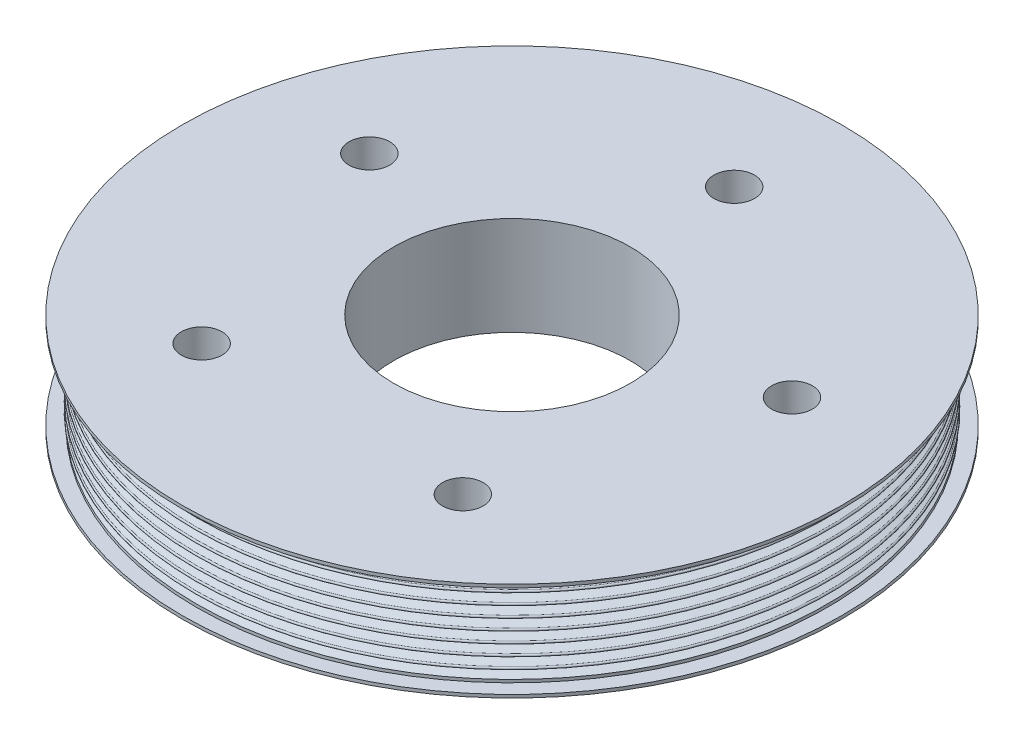
ISO-10303-21;
HEADER;
FILE_DESCRIPTION(('STEP AP214'),'2;1');
FILE_NAME('part.step','',(''),(''),'','','');
FILE_SCHEMA(('AUTOMOTIVE_DESIGN { 1 0 10303 214 1 1 1 1 }'));
ENDSEC;
DATA;
#1=APPLICATION_CONTEXT('core data for automotive mechanical design processes');
#2=APPLICATION_PROTOCOL_DEFINITION('international standard','automotive_design',2000,#1);
#3=PRODUCT_CONTEXT('',#1,'mechanical');
#4=PRODUCT('Part','Part','',(#3));
#5=PRODUCT_RELATED_PRODUCT_CATEGORY('part','',(#4));
#6=PRODUCT_DEFINITION_FORMATION('','',#4);
#7=PRODUCT_DEFINITION_CONTEXT('part definition',#1,'design');
#8=PRODUCT_DEFINITION('design','',#6,#7);
#9=PRODUCT_DEFINITION_SHAPE('','',#8);
#10=(LENGTH_UNIT() NAMED_UNIT(*) SI_UNIT(.MILLI.,.METRE.));
#11=(NAMED_UNIT(*) PLANE_ANGLE_UNIT() SI_UNIT($,.RADIAN.));
#12=(NAMED_UNIT(*) SI_UNIT($,.STERADIAN.) SOLID_ANGLE_UNIT());
#13=UNCERTAINTY_MEASURE_WITH_UNIT(LENGTH_MEASURE(1.E-05),#10,'distance_accuracy_value','');
#14=(GEOMETRIC_REPRESENTATION_CONTEXT(3) GLOBAL_UNCERTAINTY_ASSIGNED_CONTEXT((#13)) GLOBAL_UNIT_ASSIGNED_CONTEXT((#10,
#11,#12)) REPRESENTATION_CONTEXT('',''));
#15=CARTESIAN_POINT('',(0.,0.,0.));
#16=DIRECTION('',(0.,0.,1.));
#17=DIRECTION('',(1.,0.,0.));
#18=AXIS2_PLACEMENT_3D('',#15,#16,#17);
#19=CARTESIAN_POINT('',(106.172,-15.87246,0.));
#20=DIRECTION('',(0.,1.,0.));
#21=DIRECTION('',(0.,0.,1.));
#22=AXIS2_PLACEMENT_3D('',#19,#20,#21);
#23=PLANE('',#22);
#24=CARTESIAN_POINT('',(0.,-15.87246,0.));
#25=DIRECTION('',(0.,1.,0.));
#26=DIRECTION('',(0.,0.,1.));
#27=AXIS2_PLACEMENT_3D('',#24,#25,#26);
#28=CIRCLE('',#27,106.172);
#29=CARTESIAN_POINT('',(0.,-15.87246,106.172));
#30=VERTEX_POINT('',#29);
#31=EDGE_CURVE('E10',#30,#30,#28,.T.);
#32=ORIENTED_EDGE('',*,*,#31,.F.);
#33=EDGE_LOOP('',(#32));
#34=FACE_BOUND('',#33,.T.);
#35=CARTESIAN_POINT('',(0.,-15.87246,0.));
#36=DIRECTION('',(0.,1.,0.));
#37=DIRECTION('',(0.,0.,1.));
#38=AXIS2_PLACEMENT_3D('',#35,#36,#37);
#39=CIRCLE('',#38,38.1);
#40=CARTESIAN_POINT('',(0.,-15.87246,38.1));
#41=VERTEX_POINT('',#40);
#42=EDGE_CURVE('E154',#41,#41,#39,.T.);
#43=ORIENTED_EDGE('',*,*,#42,.T.);
#44=EDGE_LOOP('',(#43));
#45=FACE_BOUND('',#44,.T.);
#46=CARTESIAN_POINT('',(0.,-15.87246,-71.5518));
#47=DIRECTION('',(0.,-1.,0.));
#48=DIRECTION('',(0.,0.,-1.));
#49=AXIS2_PLACEMENT_3D('',#46,#47,#48);
#50=CIRCLE('',#49,6.54812);
#51=CARTESIAN_POINT('',(0.,-15.87246,-78.09992));
#52=VERTEX_POINT('',#51);
#53=EDGE_CURVE('E163',#52,#52,#50,.T.);
#54=ORIENTED_EDGE('',*,*,#53,.F.);
#55=EDGE_LOOP('',(#54));
#56=FACE_BOUND('',#55,.T.);
#57=CARTESIAN_POINT('',(-68.0498056426477,-15.87246,-22.1107221781172));
#58=DIRECTION('',(0.,-1.,0.));
#59=DIRECTION('',(0.,0.,-1.));
#60=AXIS2_PLACEMENT_3D('',#57,#58,#59);
#61=CIRCLE('',#60,6.54812);
#62=CARTESIAN_POINT('',(-68.0498056426477,-15.87246,-28.6588421781172));
#63=VERTEX_POINT('',#62);
#64=EDGE_CURVE('E169',#63,#63,#61,.T.);
#65=ORIENTED_EDGE('',*,*,#64,.F.);
#66=EDGE_LOOP('',(#65));
#67=FACE_BOUND('',#66,.T.);
#68=CARTESIAN_POINT('',(-42.0570928149803,-15.87246,57.8866221781176));
#69=DIRECTION('',(0.,-1.,0.));
#70=DIRECTION('',(0.,0.,-1.));
#71=AXIS2_PLACEMENT_3D('',#68,#69,#70);
#72=CIRCLE('',#71,6.54812);
#73=CARTESIAN_POINT('',(-42.0570928149803,-15.87246,51.3385021781176));
#74=VERTEX_POINT('',#73);
#75=EDGE_CURVE('E175',#74,#74,#72,.T.);
#76=ORIENTED_EDGE('',*,*,#75,.F.);
#77=EDGE_LOOP('',(#76));
#78=FACE_BOUND('',#77,.T.);
#79=CARTESIAN_POINT('',(42.0570928149811,-15.87246,57.886622178117));
#80=DIRECTION('',(0.,-1.,0.));
#81=DIRECTION('',(0.,0.,-1.));
#82=AXIS2_PLACEMENT_3D('',#79,#80,#81);
#83=CIRCLE('',#82,6.54812);
#84=CARTESIAN_POINT('',(42.0570928149811,-15.87246,51.338502178117));
#85=VERTEX_POINT('',#84);
#86=EDGE_CURVE('E181',#85,#85,#83,.T.);
#87=ORIENTED_EDGE('',*,*,#86,.F.);
#88=EDGE_LOOP('',(#87));
#89=FACE_BOUND('',#88,.T.);
#90=CARTESIAN_POINT('',(68.0498056426473,-15.87246,-22.1107221781181));
#91=DIRECTION('',(0.,-1.,0.));
#92=DIRECTION('',(0.,0.,-1.));
#93=AXIS2_PLACEMENT_3D('',#90,#91,#92);
#94=CIRCLE('',#93,6.54811999999999);
#95=CARTESIAN_POINT('',(68.0498056426473,-15.87246,-28.6588421781181));
#96=VERTEX_POINT('',#95);
#97=EDGE_CURVE('E187',#96,#96,#94,.T.);
#98=ORIENTED_EDGE('',*,*,#97,.F.);
#99=EDGE_LOOP('',(#98));
#100=FACE_BOUND('',#99,.T.);
#101=ADVANCED_FACE('F33',(#34,#45,#56,#67,#78,#89,#100),#23,.F.);
#102=CARTESIAN_POINT('',(0.,15.87246,0.));
#103=DIRECTION('',(0.,1.,0.));
#104=DIRECTION('',(0.,0.,1.));
#105=AXIS2_PLACEMENT_3D('',#102,#103,#104);
#106=CYLINDRICAL_SURFACE('',#105,106.172);
#107=CARTESIAN_POINT('',(0.,-14.85646,0.));
#108=DIRECTION('',(0.,1.,0.));
#109=DIRECTION('',(0.,0.,1.));
#110=AXIS2_PLACEMENT_3D('',#107,#108,#109);
#111=CIRCLE('',#110,106.172);
#112=CARTESIAN_POINT('',(0.,-14.85646,106.172));
#113=VERTEX_POINT('',#112);
#114=EDGE_CURVE('E39',#113,#113,#111,.T.);
#115=ORIENTED_EDGE('',*,*,#114,.F.);
#116=EDGE_LOOP('',(#115));
#117=FACE_BOUND('',#116,.T.);
#118=ORIENTED_EDGE('',*,*,#31,.T.);
#119=EDGE_LOOP('',(#118));
#120=FACE_BOUND('',#119,.T.);
#121=ADVANCED_FACE('F194',(#117,#120),#106,.T.);
#122=CARTESIAN_POINT('',(106.172,-14.85646,0.));
#123=DIRECTION('',(0.,-1.,0.));
#124=DIRECTION('',(0.,0.,-1.));
#125=AXIS2_PLACEMENT_3D('',#122,#123,#124);
#126=PLANE('',#125);
#127=CARTESIAN_POINT('',(0.,-14.85646,0.));
#128=DIRECTION('',(0.,1.,0.));
#129=DIRECTION('',(0.,0.,1.));
#130=AXIS2_PLACEMENT_3D('',#127,#128,#129);
#131=CIRCLE('',#130,101.6);
#132=CARTESIAN_POINT('',(0.,-14.85646,101.6));
#133=VERTEX_POINT('',#132);
#134=EDGE_CURVE('E43',#133,#133,#131,.T.);
#135=ORIENTED_EDGE('',*,*,#134,.F.);
#136=EDGE_LOOP('',(#135));
#137=FACE_BOUND('',#136,.T.);
#138=ORIENTED_EDGE('',*,*,#114,.T.);
#139=EDGE_LOOP('',(#138));
#140=FACE_BOUND('',#139,.T.);
#141=ADVANCED_FACE('F199',(#137,#140),#126,.F.);
#142=CARTESIAN_POINT('',(0.,15.87246,0.));
#143=DIRECTION('',(0.,1.,0.));
#144=DIRECTION('',(0.,0.,1.));
#145=AXIS2_PLACEMENT_3D('',#142,#143,#144);
#146=CYLINDRICAL_SURFACE('',#145,101.6);
#147=CARTESIAN_POINT('',(0.,-13.90396,0.));
#148=DIRECTION('',(0.,1.,0.));
#149=DIRECTION('',(0.,0.,1.));
#150=AXIS2_PLACEMENT_3D('',#147,#148,#149);
#151=CIRCLE('',#150,101.6);
#152=CARTESIAN_POINT('',(0.,-13.90396,101.6));
#153=VERTEX_POINT('',#152);
#154=EDGE_CURVE('E47',#153,#153,#151,.T.);
#155=ORIENTED_EDGE('',*,*,#154,.F.);
#156=EDGE_LOOP('',(#155));
#157=FACE_BOUND('',#156,.T.);
#158=ORIENTED_EDGE('',*,*,#134,.T.);
#159=EDGE_LOOP('',(#158));
#160=FACE_BOUND('',#159,.T.);
#161=ADVANCED_FACE('F378',(#157,#160),#146,.T.);
#162=CARTESIAN_POINT('',(0.,-13.90396,0.));
#163=DIRECTION('',(0.,-1.,0.));
#164=DIRECTION('',(0.,0.,-1.));
#165=AXIS2_PLACEMENT_3D('',#162,#163,#164);
#166=CONICAL_SURFACE('',#165,101.6,1.22173047639603);
#167=CARTESIAN_POINT('',(0.,-12.88034,0.));
#168=DIRECTION('',(0.,1.,0.));
#169=DIRECTION('',(0.,0.,1.));
#170=AXIS2_PLACEMENT_3D('',#167,#168,#169);
#171=CIRCLE('',#170,98.7876271638978);
#172=CARTESIAN_POINT('',(0.,-12.88034,98.7876271638978));
#173=VERTEX_POINT('',#172);
#174=EDGE_CURVE('E52',#173,#173,#171,.T.);
#175=ORIENTED_EDGE('',*,*,#174,.F.);
#176=EDGE_LOOP('',(#175));
#177=FACE_BOUND('',#176,.T.);
#178=ORIENTED_EDGE('',*,*,#154,.T.);
#179=EDGE_LOOP('',(#178));
#180=FACE_BOUND('',#179,.T.);
#181=ADVANCED_FACE('F374',(#177,#180),#166,.T.);
#182=CARTESIAN_POINT('',(0.,-12.49934,0.));
#183=DIRECTION('',(0.,1.,0.));
#184=DIRECTION('',(0.,0.,1.));
#185=AXIS2_PLACEMENT_3D('',#182,#183,#184);
#186=TOROIDAL_SURFACE('',#185,98.7876271638978,0.380999999999995);
#187=CARTESIAN_POINT('',(0.,-12.11834,0.));
#188=DIRECTION('',(0.,1.,0.));
#189=DIRECTION('',(0.,0.,1.));
#190=AXIS2_PLACEMENT_3D('',#187,#188,#189);
#191=CIRCLE('',#190,98.7876271638978);
#192=CARTESIAN_POINT('',(0.,-12.11834,98.7876271638978));
#193=VERTEX_POINT('',#192);
#194=EDGE_CURVE('E55',#193,#193,#191,.T.);
#195=ORIENTED_EDGE('',*,*,#194,.F.);
#196=EDGE_LOOP('',(#195));
#197=FACE_BOUND('',#196,.T.);
#198=ORIENTED_EDGE('',*,*,#174,.T.);
#199=EDGE_LOOP('',(#198));
#200=FACE_BOUND('',#199,.T.);
#201=ADVANCED_FACE('F370',(#197,#200),#186,.F.);
#202=CARTESIAN_POINT('',(0.,-12.11834,0.));
#203=DIRECTION('',(0.,1.,0.));
#204=DIRECTION('',(0.,0.,1.));
#205=AXIS2_PLACEMENT_3D('',#202,#203,#204);
#206=CONICAL_SURFACE('',#205,98.7876271638978,1.22173047639604);
#207=CARTESIAN_POINT('',(0.,-11.09472,0.));
#208=DIRECTION('',(0.,1.,0.));
#209=DIRECTION('',(0.,0.,1.));
#210=AXIS2_PLACEMENT_3D('',#207,#208,#209);
#211=CIRCLE('',#210,101.6);
#212=CARTESIAN_POINT('',(0.,-11.09472,101.6));
#213=VERTEX_POINT('',#212);
#214=EDGE_CURVE('E58',#213,#213,#211,.T.);
#215=ORIENTED_EDGE('',*,*,#214,.F.);
#216=EDGE_LOOP('',(#215));
#217=FACE_BOUND('',#216,.T.);
#218=ORIENTED_EDGE('',*,*,#194,.T.);
#219=EDGE_LOOP('',(#218));
#220=FACE_BOUND('',#219,.T.);
#221=ADVANCED_FACE('F366',(#217,#220),#206,.T.);
#222=CARTESIAN_POINT('',(0.,-10.71372,0.));
#223=DIRECTION('',(0.,1.,0.));
#224=DIRECTION('',(0.,0.,1.));
#225=AXIS2_PLACEMENT_3D('',#222,#223,#224);
#226=TOROIDAL_SURFACE('',#225,101.6,0.380999999999999);
#227=CARTESIAN_POINT('',(0.,-10.33272,0.));
#228=DIRECTION('',(0.,1.,0.));
#229=DIRECTION('',(0.,0.,1.));
#230=AXIS2_PLACEMENT_3D('',#227,#228,#229);
#231=CIRCLE('',#230,101.6);
#232=CARTESIAN_POINT('',(0.,-10.33272,101.6));
#233=VERTEX_POINT('',#232);
#234=EDGE_CURVE('E61',#233,#233,#231,.T.);
#235=ORIENTED_EDGE('',*,*,#234,.F.);
#236=EDGE_LOOP('',(#235));
#237=FACE_BOUND('',#236,.T.);
#238=ORIENTED_EDGE('',*,*,#214,.T.);
#239=EDGE_LOOP('',(#238));
#240=FACE_BOUND('',#239,.T.);
#241=ADVANCED_FACE('F362',(#237,#240),#226,.T.);
#242=CARTESIAN_POINT('',(0.,-10.33272,0.));
#243=DIRECTION('',(0.,-1.,0.));
#244=DIRECTION('',(0.,0.,-1.));
#245=AXIS2_PLACEMENT_3D('',#242,#243,#244);
#246=CONICAL_SURFACE('',#245,101.6,1.22173047639603);
#247=CARTESIAN_POINT('',(0.,-9.30909999999999,0.));
#248=DIRECTION('',(0.,1.,0.));
#249=DIRECTION('',(0.,0.,1.));
#250=AXIS2_PLACEMENT_3D('',#247,#248,#249);
#251=CIRCLE('',#250,98.7876271638978);
#252=CARTESIAN_POINT('',(0.,-9.30909999999999,98.7876271638978));
#253=VERTEX_POINT('',#252);
#254=EDGE_CURVE('E64',#253,#253,#251,.T.);
#255=ORIENTED_EDGE('',*,*,#254,.F.);
#256=EDGE_LOOP('',(#255));
#257=FACE_BOUND('',#256,.T.);
#258=ORIENTED_EDGE('',*,*,#234,.T.);
#259=EDGE_LOOP('',(#258));
#260=FACE_BOUND('',#259,.T.);
#261=ADVANCED_FACE('F358',(#257,#260),#246,.T.);
#262=CARTESIAN_POINT('',(0.,-8.92809999999999,0.));
#263=DIRECTION('',(0.,1.,0.));
#264=DIRECTION('',(0.,0.,1.));
#265=AXIS2_PLACEMENT_3D('',#262,#263,#264);
#266=TOROIDAL_SURFACE('',#265,98.7876271638978,0.381);
#267=CARTESIAN_POINT('',(0.,-8.54709999999999,0.));
#268=DIRECTION('',(0.,1.,0.));
#269=DIRECTION('',(0.,0.,1.));
#270=AXIS2_PLACEMENT_3D('',#267,#268,#269);
#271=CIRCLE('',#270,98.7876271638978);
#272=CARTESIAN_POINT('',(0.,-8.54709999999999,98.7876271638978));
#273=VERTEX_POINT('',#272);
#274=EDGE_CURVE('E67',#273,#273,#271,.T.);
#275=ORIENTED_EDGE('',*,*,#274,.F.);
#276=EDGE_LOOP('',(#275));
#277=FACE_BOUND('',#276,.T.);
#278=ORIENTED_EDGE('',*,*,#254,.T.);
#279=EDGE_LOOP('',(#278));
#280=FACE_BOUND('',#279,.T.);
#281=ADVANCED_FACE('F354',(#277,#280),#266,.F.);
#282=CARTESIAN_POINT('',(0.,-8.54709999999999,0.));
#283=DIRECTION('',(0.,1.,0.));
#284=DIRECTION('',(0.,0.,1.));
#285=AXIS2_PLACEMENT_3D('',#282,#283,#284);
#286=CONICAL_SURFACE('',#285,98.7876271638978,1.22173047639604);
#287=CARTESIAN_POINT('',(0.,-7.52348,0.));
#288=DIRECTION('',(0.,1.,0.));
#289=DIRECTION('',(0.,0.,1.));
#290=AXIS2_PLACEMENT_3D('',#287,#288,#289);
#291=CIRCLE('',#290,101.6);
#292=CARTESIAN_POINT('',(0.,-7.52348,101.6));
#293=VERTEX_POINT('',#292);
#294=EDGE_CURVE('E70',#293,#293,#291,.T.);
#295=ORIENTED_EDGE('',*,*,#294,.F.);
#296=EDGE_LOOP('',(#295));
#297=FACE_BOUND('',#296,.T.);
#298=ORIENTED_EDGE('',*,*,#274,.T.);
#299=EDGE_LOOP('',(#298));
#300=FACE_BOUND('',#299,.T.);
#301=ADVANCED_FACE('F350',(#297,#300),#286,.T.);
#302=CARTESIAN_POINT('',(0.,-7.14248,0.));
#303=DIRECTION('',(0.,1.,0.));
#304=DIRECTION('',(0.,0.,1.));
#305=AXIS2_PLACEMENT_3D('',#302,#303,#304);
#306=TOROIDAL_SURFACE('',#305,101.6,0.381000000000001);
#307=CARTESIAN_POINT('',(0.,-6.76148,0.));
#308=DIRECTION('',(0.,1.,0.));
#309=DIRECTION('',(0.,0.,1.));
#310=AXIS2_PLACEMENT_3D('',#307,#308,#309);
#311=CIRCLE('',#310,101.6);
#312=CARTESIAN_POINT('',(0.,-6.76148,101.6));
#313=VERTEX_POINT('',#312);
#314=EDGE_CURVE('E73',#313,#313,#311,.T.);
#315=ORIENTED_EDGE('',*,*,#314,.F.);
#316=EDGE_LOOP('',(#315));
#317=FACE_BOUND('',#316,.T.);
#318=ORIENTED_EDGE('',*,*,#294,.T.);
#319=EDGE_LOOP('',(#318));
#320=FACE_BOUND('',#319,.T.);
#321=ADVANCED_FACE('F346',(#317,#320),#306,.T.);
#322=CARTESIAN_POINT('',(0.,-6.76148,0.));
#323=DIRECTION('',(0.,-1.,0.));
#324=DIRECTION('',(0.,0.,-1.));
#325=AXIS2_PLACEMENT_3D('',#322,#323,#324);
#326=CONICAL_SURFACE('',#325,101.6,1.22173047639603);
#327=CARTESIAN_POINT('',(0.,-5.73785999999998,0.));
#328=DIRECTION('',(0.,1.,0.));
#329=DIRECTION('',(0.,0.,1.));
#330=AXIS2_PLACEMENT_3D('',#327,#328,#329);
#331=CIRCLE('',#330,98.7876271638978);
#332=CARTESIAN_POINT('',(0.,-5.73785999999998,98.7876271638978));
#333=VERTEX_POINT('',#332);
#334=EDGE_CURVE('E76',#333,#333,#331,.T.);
#335=ORIENTED_EDGE('',*,*,#334,.F.);
#336=EDGE_LOOP('',(#335));
#337=FACE_BOUND('',#336,.T.);
#338=ORIENTED_EDGE('',*,*,#314,.T.);
#339=EDGE_LOOP('',(#338));
#340=FACE_BOUND('',#339,.T.);
#341=ADVANCED_FACE('F342',(#337,#340),#326,.T.);
#342=CARTESIAN_POINT('',(0.,-5.35685999999998,0.));
#343=DIRECTION('',(0.,1.,0.));
#344=DIRECTION('',(0.,0.,1.));
#345=AXIS2_PLACEMENT_3D('',#342,#343,#344);
#346=TOROIDAL_SURFACE('',#345,98.7876271638978,0.381);
#347=CARTESIAN_POINT('',(0.,-4.97585999999998,0.));
#348=DIRECTION('',(0.,1.,0.));
#349=DIRECTION('',(0.,0.,1.));
#350=AXIS2_PLACEMENT_3D('',#347,#348,#349);
#351=CIRCLE('',#350,98.7876271638978);
#352=CARTESIAN_POINT('',(0.,-4.97585999999998,98.7876271638978));
#353=VERTEX_POINT('',#352);
#354=EDGE_CURVE('E79',#353,#353,#351,.T.);
#355=ORIENTED_EDGE('',*,*,#354,.F.);
#356=EDGE_LOOP('',(#355));
#357=FACE_BOUND('',#356,.T.);
#358=ORIENTED_EDGE('',*,*,#334,.T.);
#359=EDGE_LOOP('',(#358));
#360=FACE_BOUND('',#359,.T.);
#361=ADVANCED_FACE('F338',(#357,#360),#346,.F.);
#362=CARTESIAN_POINT('',(0.,-4.97585999999998,0.));
#363=DIRECTION('',(0.,1.,0.));
#364=DIRECTION('',(0.,0.,1.));
#365=AXIS2_PLACEMENT_3D('',#362,#363,#364);
#366=CONICAL_SURFACE('',#365,98.7876271638978,1.22173047639604);
#367=CARTESIAN_POINT('',(0.,-3.95223999999999,0.));
#368=DIRECTION('',(0.,1.,0.));
#369=DIRECTION('',(0.,0.,1.));
#370=AXIS2_PLACEMENT_3D('',#367,#368,#369);
#371=CIRCLE('',#370,101.6);
#372=CARTESIAN_POINT('',(0.,-3.95223999999999,101.6));
#373=VERTEX_POINT('',#372);
#374=EDGE_CURVE('E82',#373,#373,#371,.T.);
#375=ORIENTED_EDGE('',*,*,#374,.F.);
#376=EDGE_LOOP('',(#375));
#377=FACE_BOUND('',#376,.T.);
#378=ORIENTED_EDGE('',*,*,#354,.T.);
#379=EDGE_LOOP('',(#378));
#380=FACE_BOUND('',#379,.T.);
#381=ADVANCED_FACE('F334',(#377,#380),#366,.T.);
#382=CARTESIAN_POINT('',(0.,-3.57123999999999,0.));
#383=DIRECTION('',(0.,1.,0.));
#384=DIRECTION('',(0.,0.,1.));
#385=AXIS2_PLACEMENT_3D('',#382,#383,#384);
#386=TOROIDAL_SURFACE('',#385,101.6,0.380999999999999);
#387=CARTESIAN_POINT('',(0.,-3.19023999999999,0.));
#388=DIRECTION('',(0.,1.,0.));
#389=DIRECTION('',(0.,0.,1.));
#390=AXIS2_PLACEMENT_3D('',#387,#388,#389);
#391=CIRCLE('',#390,101.6);
#392=CARTESIAN_POINT('',(0.,-3.19023999999999,101.6));
#393=VERTEX_POINT('',#392);
#394=EDGE_CURVE('E85',#393,#393,#391,.T.);
#395=ORIENTED_EDGE('',*,*,#394,.F.);
#396=EDGE_LOOP('',(#395));
#397=FACE_BOUND('',#396,.T.);
#398=ORIENTED_EDGE('',*,*,#374,.T.);
#399=EDGE_LOOP('',(#398));
#400=FACE_BOUND('',#399,.T.);
#401=ADVANCED_FACE('F330',(#397,#400),#386,.T.);
#402=CARTESIAN_POINT('',(0.,-3.19023999999999,0.));
#403=DIRECTION('',(0.,-1.,0.));
#404=DIRECTION('',(0.,0.,-1.));
#405=AXIS2_PLACEMENT_3D('',#402,#403,#404);
#406=CONICAL_SURFACE('',#405,101.6,1.22173047639603);
#407=CARTESIAN_POINT('',(0.,-2.16661999999999,0.));
#408=DIRECTION('',(0.,1.,0.));
#409=DIRECTION('',(0.,0.,1.));
#410=AXIS2_PLACEMENT_3D('',#407,#408,#409);
#411=CIRCLE('',#410,98.7876271638978);
#412=CARTESIAN_POINT('',(0.,-2.16661999999999,98.7876271638978));
#413=VERTEX_POINT('',#412);
#414=EDGE_CURVE('E88',#413,#413,#411,.T.);
#415=ORIENTED_EDGE('',*,*,#414,.F.);
#416=EDGE_LOOP('',(#415));
#417=FACE_BOUND('',#416,.T.);
#418=ORIENTED_EDGE('',*,*,#394,.T.);
#419=EDGE_LOOP('',(#418));
#420=FACE_BOUND('',#419,.T.);
#421=ADVANCED_FACE('F326',(#417,#420),#406,.T.);
#422=CARTESIAN_POINT('',(0.,-1.78561999999999,0.));
#423=DIRECTION('',(0.,1.,0.));
#424=DIRECTION('',(0.,0.,1.));
#425=AXIS2_PLACEMENT_3D('',#422,#423,#424);
#426=TOROIDAL_SURFACE('',#425,98.7876271638978,0.381);
#427=CARTESIAN_POINT('',(0.,-1.40461999999999,0.));
#428=DIRECTION('',(0.,1.,0.));
#429=DIRECTION('',(0.,0.,1.));
#430=AXIS2_PLACEMENT_3D('',#427,#428,#429);
#431=CIRCLE('',#430,98.7876271638978);
#432=CARTESIAN_POINT('',(0.,-1.40461999999999,98.7876271638978));
#433=VERTEX_POINT('',#432);
#434=EDGE_CURVE('E91',#433,#433,#431,.T.);
#435=ORIENTED_EDGE('',*,*,#434,.F.);
#436=EDGE_LOOP('',(#435));
#437=FACE_BOUND('',#436,.T.);
#438=ORIENTED_EDGE('',*,*,#414,.T.);
#439=EDGE_LOOP('',(#438));
#440=FACE_BOUND('',#439,.T.);
#441=ADVANCED_FACE('F322',(#437,#440),#426,.F.);
#442=CARTESIAN_POINT('',(0.,-1.40461999999999,0.));
#443=DIRECTION('',(0.,1.,0.));
#444=DIRECTION('',(0.,0.,1.));
#445=AXIS2_PLACEMENT_3D('',#442,#443,#444);
#446=CONICAL_SURFACE('',#445,98.7876271638978,1.22173047639604);
#447=CARTESIAN_POINT('',(0.,-0.381000000000003,0.));
#448=DIRECTION('',(0.,1.,0.));
#449=DIRECTION('',(0.,0.,1.));
#450=AXIS2_PLACEMENT_3D('',#447,#448,#449);
#451=CIRCLE('',#450,101.6);
#452=CARTESIAN_POINT('',(0.,-0.381000000000003,101.6));
#453=VERTEX_POINT('',#452);
#454=EDGE_CURVE('E94',#453,#453,#451,.T.);
#455=ORIENTED_EDGE('',*,*,#454,.F.);
#456=EDGE_LOOP('',(#455));
#457=FACE_BOUND('',#456,.T.);
#458=ORIENTED_EDGE('',*,*,#434,.T.);
#459=EDGE_LOOP('',(#458));
#460=FACE_BOUND('',#459,.T.);
#461=ADVANCED_FACE('F318',(#457,#460),#446,.T.);
#462=CARTESIAN_POINT('',(0.,0.,0.));
#463=DIRECTION('',(0.,1.,0.));
#464=DIRECTION('',(0.,0.,1.));
#465=AXIS2_PLACEMENT_3D('',#462,#463,#464);
#466=TOROIDAL_SURFACE('',#465,101.6,0.381);
#467=CARTESIAN_POINT('',(0.,0.380999999999998,0.));
#468=DIRECTION('',(0.,1.,0.));
#469=DIRECTION('',(0.,0.,1.));
#470=AXIS2_PLACEMENT_3D('',#467,#468,#469);
#471=CIRCLE('',#470,101.6);
#472=CARTESIAN_POINT('',(0.,0.380999999999998,101.6));
#473=VERTEX_POINT('',#472);
#474=EDGE_CURVE('E97',#473,#473,#471,.T.);
#475=ORIENTED_EDGE('',*,*,#474,.F.);
#476=EDGE_LOOP('',(#475));
#477=FACE_BOUND('',#476,.T.);
#478=ORIENTED_EDGE('',*,*,#454,.T.);
#479=EDGE_LOOP('',(#478));
#480=FACE_BOUND('',#479,.T.);
#481=ADVANCED_FACE('F314',(#477,#480),#466,.T.);
#482=CARTESIAN_POINT('',(0.,0.380999999999998,0.));
#483=DIRECTION('',(0.,-1.,0.));
#484=DIRECTION('',(0.,0.,-1.));
#485=AXIS2_PLACEMENT_3D('',#482,#483,#484);
#486=CONICAL_SURFACE('',#485,101.6,1.22173047639603);
#487=CARTESIAN_POINT('',(0.,1.40462000000001,0.));
#488=DIRECTION('',(0.,1.,0.));
#489=DIRECTION('',(0.,0.,1.));
#490=AXIS2_PLACEMENT_3D('',#487,#488,#489);
#491=CIRCLE('',#490,98.7876271638978);
#492=CARTESIAN_POINT('',(0.,1.40462000000001,98.7876271638978));
#493=VERTEX_POINT('',#492);
#494=EDGE_CURVE('E100',#493,#493,#491,.T.);
#495=ORIENTED_EDGE('',*,*,#494,.F.);
#496=EDGE_LOOP('',(#495));
#497=FACE_BOUND('',#496,.T.);
#498=ORIENTED_EDGE('',*,*,#474,.T.);
#499=EDGE_LOOP('',(#498));
#500=FACE_BOUND('',#499,.T.);
#501=ADVANCED_FACE('F310',(#497,#500),#486,.T.);
#502=CARTESIAN_POINT('',(0.,1.78562000000001,0.));
#503=DIRECTION('',(0.,1.,0.));
#504=DIRECTION('',(0.,0.,1.));
#505=AXIS2_PLACEMENT_3D('',#502,#503,#504);
#506=TOROIDAL_SURFACE('',#505,98.7876271638978,0.381);
#507=CARTESIAN_POINT('',(0.,2.16662000000001,0.));
#508=DIRECTION('',(0.,1.,0.));
#509=DIRECTION('',(0.,0.,1.));
#510=AXIS2_PLACEMENT_3D('',#507,#508,#509);
#511=CIRCLE('',#510,98.7876271638978);
#512=CARTESIAN_POINT('',(0.,2.16662000000001,98.7876271638978));
#513=VERTEX_POINT('',#512);
#514=EDGE_CURVE('E103',#513,#513,#511,.T.);
#515=ORIENTED_EDGE('',*,*,#514,.F.);
#516=EDGE_LOOP('',(#515));
#517=FACE_BOUND('',#516,.T.);
#518=ORIENTED_EDGE('',*,*,#494,.T.);
#519=EDGE_LOOP('',(#518));
#520=FACE_BOUND('',#519,.T.);
#521=ADVANCED_FACE('F306',(#517,#520),#506,.F.);
#522=CARTESIAN_POINT('',(0.,2.16662000000001,0.));
#523=DIRECTION('',(0.,1.,0.));
#524=DIRECTION('',(0.,0.,1.));
#525=AXIS2_PLACEMENT_3D('',#522,#523,#524);
#526=CONICAL_SURFACE('',#525,98.7876271638978,1.22173047639604);
#527=CARTESIAN_POINT('',(0.,3.19024,0.));
#528=DIRECTION('',(0.,1.,0.));
#529=DIRECTION('',(0.,0.,1.));
#530=AXIS2_PLACEMENT_3D('',#527,#528,#529);
#531=CIRCLE('',#530,101.6);
#532=CARTESIAN_POINT('',(0.,3.19024,101.6));
#533=VERTEX_POINT('',#532);
#534=EDGE_CURVE('E106',#533,#533,#531,.T.);
#535=ORIENTED_EDGE('',*,*,#534,.F.);
#536=EDGE_LOOP('',(#535));
#537=FACE_BOUND('',#536,.T.);
#538=ORIENTED_EDGE('',*,*,#514,.T.);
#539=EDGE_LOOP('',(#538));
#540=FACE_BOUND('',#539,.T.);
#541=ADVANCED_FACE('F302',(#537,#540),#526,.T.);
#542=CARTESIAN_POINT('',(0.,3.57124,0.));
#543=DIRECTION('',(0.,1.,0.));
#544=DIRECTION('',(0.,0.,1.));
#545=AXIS2_PLACEMENT_3D('',#542,#543,#544);
#546=TOROIDAL_SURFACE('',#545,101.6,0.381);
#547=CARTESIAN_POINT('',(0.,3.95224,0.));
#548=DIRECTION('',(0.,1.,0.));
#549=DIRECTION('',(0.,0.,1.));
#550=AXIS2_PLACEMENT_3D('',#547,#548,#549);
#551=CIRCLE('',#550,101.6);
#552=CARTESIAN_POINT('',(0.,3.95224,101.6));
#553=VERTEX_POINT('',#552);
#554=EDGE_CURVE('E109',#553,#553,#551,.T.);
#555=ORIENTED_EDGE('',*,*,#554,.F.);
#556=EDGE_LOOP('',(#555));
#557=FACE_BOUND('',#556,.T.);
#558=ORIENTED_EDGE('',*,*,#534,.T.);
#559=EDGE_LOOP('',(#558));
#560=FACE_BOUND('',#559,.T.);
#561=ADVANCED_FACE('F298',(#557,#560),#546,.T.);
#562=CARTESIAN_POINT('',(0.,3.95224,0.));
#563=DIRECTION('',(0.,-1.,0.));
#564=DIRECTION('',(0.,0.,-1.));
#565=AXIS2_PLACEMENT_3D('',#562,#563,#564);
#566=CONICAL_SURFACE('',#565,101.6,1.22173047639603);
#567=CARTESIAN_POINT('',(0.,4.97586000000001,0.));
#568=DIRECTION('',(0.,1.,0.));
#569=DIRECTION('',(0.,0.,1.));
#570=AXIS2_PLACEMENT_3D('',#567,#568,#569);
#571=CIRCLE('',#570,98.7876271638978);
#572=CARTESIAN_POINT('',(0.,4.97586000000001,98.7876271638978));
#573=VERTEX_POINT('',#572);
#574=EDGE_CURVE('E112',#573,#573,#571,.T.);
#575=ORIENTED_EDGE('',*,*,#574,.F.);
#576=EDGE_LOOP('',(#575));
#577=FACE_BOUND('',#576,.T.);
#578=ORIENTED_EDGE('',*,*,#554,.T.);
#579=EDGE_LOOP('',(#578));
#580=FACE_BOUND('',#579,.T.);
#581=ADVANCED_FACE('F294',(#577,#580),#566,.T.);
#582=CARTESIAN_POINT('',(0.,5.35686000000001,0.));
#583=DIRECTION('',(0.,1.,0.));
#584=DIRECTION('',(0.,0.,1.));
#585=AXIS2_PLACEMENT_3D('',#582,#583,#584);
#586=TOROIDAL_SURFACE('',#585,98.7876271638978,0.381);
#587=CARTESIAN_POINT('',(0.,5.73786000000001,0.));
#588=DIRECTION('',(0.,1.,0.));
#589=DIRECTION('',(0.,0.,1.));
#590=AXIS2_PLACEMENT_3D('',#587,#588,#589);
#591=CIRCLE('',#590,98.7876271638978);
#592=CARTESIAN_POINT('',(0.,5.73786000000001,98.7876271638978));
#593=VERTEX_POINT('',#592);
#594=EDGE_CURVE('E115',#593,#593,#591,.T.);
#595=ORIENTED_EDGE('',*,*,#594,.F.);
#596=EDGE_LOOP('',(#595));
#597=FACE_BOUND('',#596,.T.);
#598=ORIENTED_EDGE('',*,*,#574,.T.);
#599=EDGE_LOOP('',(#598));
#600=FACE_BOUND('',#599,.T.);
#601=ADVANCED_FACE('F290',(#597,#600),#586,.F.);
#602=CARTESIAN_POINT('',(0.,5.73786000000001,0.));
#603=DIRECTION('',(0.,1.,0.));
#604=DIRECTION('',(0.,0.,1.));
#605=AXIS2_PLACEMENT_3D('',#602,#603,#604);
#606=CONICAL_SURFACE('',#605,98.7876271638978,1.22173047639604);
#607=CARTESIAN_POINT('',(0.,6.76148,0.));
#608=DIRECTION('',(0.,1.,0.));
#609=DIRECTION('',(0.,0.,1.));
#610=AXIS2_PLACEMENT_3D('',#607,#608,#609);
#611=CIRCLE('',#610,101.6);
#612=CARTESIAN_POINT('',(0.,6.76148,101.6));
#613=VERTEX_POINT('',#612);
#614=EDGE_CURVE('E118',#613,#613,#611,.T.);
#615=ORIENTED_EDGE('',*,*,#614,.F.);
#616=EDGE_LOOP('',(#615));
#617=FACE_BOUND('',#616,.T.);
#618=ORIENTED_EDGE('',*,*,#594,.T.);
#619=EDGE_LOOP('',(#618));
#620=FACE_BOUND('',#619,.T.);
#621=ADVANCED_FACE('F286',(#617,#620),#606,.T.);
#622=CARTESIAN_POINT('',(0.,7.14248,0.));
#623=DIRECTION('',(0.,1.,0.));
#624=DIRECTION('',(0.,0.,1.));
#625=AXIS2_PLACEMENT_3D('',#622,#623,#624);
#626=TOROIDAL_SURFACE('',#625,101.6,0.381);
#627=CARTESIAN_POINT('',(0.,7.52348,0.));
#628=DIRECTION('',(0.,1.,0.));
#629=DIRECTION('',(0.,0.,1.));
#630=AXIS2_PLACEMENT_3D('',#627,#628,#629);
#631=CIRCLE('',#630,101.6);
#632=CARTESIAN_POINT('',(0.,7.52348,101.6));
#633=VERTEX_POINT('',#632);
#634=EDGE_CURVE('E121',#633,#633,#631,.T.);
#635=ORIENTED_EDGE('',*,*,#634,.F.);
#636=EDGE_LOOP('',(#635));
#637=FACE_BOUND('',#636,.T.);
#638=ORIENTED_EDGE('',*,*,#614,.T.);
#639=EDGE_LOOP('',(#638));
#640=FACE_BOUND('',#639,.T.);
#641=ADVANCED_FACE('F282',(#637,#640),#626,.T.);
#642=CARTESIAN_POINT('',(0.,7.52348,0.));
#643=DIRECTION('',(0.,-1.,0.));
#644=DIRECTION('',(0.,0.,-1.));
#645=AXIS2_PLACEMENT_3D('',#642,#643,#644);
#646=CONICAL_SURFACE('',#645,101.6,1.22173047639603);
#647=CARTESIAN_POINT('',(0.,8.5471,0.));
#648=DIRECTION('',(0.,1.,0.));
#649=DIRECTION('',(0.,0.,1.));
#650=AXIS2_PLACEMENT_3D('',#647,#648,#649);
#651=CIRCLE('',#650,98.7876271638978);
#652=CARTESIAN_POINT('',(0.,8.5471,98.7876271638978));
#653=VERTEX_POINT('',#652);
#654=EDGE_CURVE('E124',#653,#653,#651,.T.);
#655=ORIENTED_EDGE('',*,*,#654,.F.);
#656=EDGE_LOOP('',(#655));
#657=FACE_BOUND('',#656,.T.);
#658=ORIENTED_EDGE('',*,*,#634,.T.);
#659=EDGE_LOOP('',(#658));
#660=FACE_BOUND('',#659,.T.);
#661=ADVANCED_FACE('F278',(#657,#660),#646,.T.);
#662=CARTESIAN_POINT('',(0.,8.9281,0.));
#663=DIRECTION('',(0.,1.,0.));
#664=DIRECTION('',(0.,0.,1.));
#665=AXIS2_PLACEMENT_3D('',#662,#663,#664);
#666=TOROIDAL_SURFACE('',#665,98.7876271638978,0.381000000000002);
#667=CARTESIAN_POINT('',(0.,9.3091,0.));
#668=DIRECTION('',(0.,1.,0.));
#669=DIRECTION('',(0.,0.,1.));
#670=AXIS2_PLACEMENT_3D('',#667,#668,#669);
#671=CIRCLE('',#670,98.7876271638978);
#672=CARTESIAN_POINT('',(0.,9.3091,98.7876271638978));
#673=VERTEX_POINT('',#672);
#674=EDGE_CURVE('E127',#673,#673,#671,.T.);
#675=ORIENTED_EDGE('',*,*,#674,.F.);
#676=EDGE_LOOP('',(#675));
#677=FACE_BOUND('',#676,.T.);
#678=ORIENTED_EDGE('',*,*,#654,.T.);
#679=EDGE_LOOP('',(#678));
#680=FACE_BOUND('',#679,.T.);
#681=ADVANCED_FACE('F274',(#677,#680),#666,.F.);
#682=CARTESIAN_POINT('',(0.,9.3091,0.));
#683=DIRECTION('',(0.,1.,0.));
#684=DIRECTION('',(0.,0.,1.));
#685=AXIS2_PLACEMENT_3D('',#682,#683,#684);
#686=CONICAL_SURFACE('',#685,98.7876271638978,1.22173047639604);
#687=CARTESIAN_POINT('',(0.,10.33272,0.));
#688=DIRECTION('',(0.,1.,0.));
#689=DIRECTION('',(0.,0.,1.));
#690=AXIS2_PLACEMENT_3D('',#687,#688,#689);
#691=CIRCLE('',#690,101.6);
#692=CARTESIAN_POINT('',(0.,10.33272,101.6));
#693=VERTEX_POINT('',#692);
#694=EDGE_CURVE('E130',#693,#693,#691,.T.);
#695=ORIENTED_EDGE('',*,*,#694,.F.);
#696=EDGE_LOOP('',(#695));
#697=FACE_BOUND('',#696,.T.);
#698=ORIENTED_EDGE('',*,*,#674,.T.);
#699=EDGE_LOOP('',(#698));
#700=FACE_BOUND('',#699,.T.);
#701=ADVANCED_FACE('F270',(#697,#700),#686,.T.);
#702=CARTESIAN_POINT('',(0.,10.71372,0.));
#703=DIRECTION('',(0.,1.,0.));
#704=DIRECTION('',(0.,0.,1.));
#705=AXIS2_PLACEMENT_3D('',#702,#703,#704);
#706=TOROIDAL_SURFACE('',#705,101.6,0.381);
#707=CARTESIAN_POINT('',(0.,11.09472,0.));
#708=DIRECTION('',(0.,1.,0.));
#709=DIRECTION('',(0.,0.,1.));
#710=AXIS2_PLACEMENT_3D('',#707,#708,#709);
#711=CIRCLE('',#710,101.6);
#712=CARTESIAN_POINT('',(0.,11.09472,101.6));
#713=VERTEX_POINT('',#712);
#714=EDGE_CURVE('E133',#713,#713,#711,.T.);
#715=ORIENTED_EDGE('',*,*,#714,.F.);
#716=EDGE_LOOP('',(#715));
#717=FACE_BOUND('',#716,.T.);
#718=ORIENTED_EDGE('',*,*,#694,.T.);
#719=EDGE_LOOP('',(#718));
#720=FACE_BOUND('',#719,.T.);
#721=ADVANCED_FACE('F266',(#717,#720),#706,.T.);
#722=CARTESIAN_POINT('',(0.,11.09472,0.));
#723=DIRECTION('',(0.,-1.,0.));
#724=DIRECTION('',(0.,0.,-1.));
#725=AXIS2_PLACEMENT_3D('',#722,#723,#724);
#726=CONICAL_SURFACE('',#725,101.6,1.22173047639603);
#727=CARTESIAN_POINT('',(0.,12.11834,0.));
#728=DIRECTION('',(0.,1.,0.));
#729=DIRECTION('',(0.,0.,1.));
#730=AXIS2_PLACEMENT_3D('',#727,#728,#729);
#731=CIRCLE('',#730,98.7876271638978);
#732=CARTESIAN_POINT('',(0.,12.11834,98.7876271638978));
#733=VERTEX_POINT('',#732);
#734=EDGE_CURVE('E136',#733,#733,#731,.T.);
#735=ORIENTED_EDGE('',*,*,#734,.F.);
#736=EDGE_LOOP('',(#735));
#737=FACE_BOUND('',#736,.T.);
#738=ORIENTED_EDGE('',*,*,#714,.T.);
#739=EDGE_LOOP('',(#738));
#740=FACE_BOUND('',#739,.T.);
#741=ADVANCED_FACE('F262',(#737,#740),#726,.T.);
#742=CARTESIAN_POINT('',(0.,12.49934,0.));
#743=DIRECTION('',(0.,1.,0.));
#744=DIRECTION('',(0.,0.,1.));
#745=AXIS2_PLACEMENT_3D('',#742,#743,#744);
#746=TOROIDAL_SURFACE('',#745,98.7876271638978,0.380999999999998);
#747=CARTESIAN_POINT('',(0.,12.88034,0.));
#748=DIRECTION('',(0.,1.,0.));
#749=DIRECTION('',(0.,0.,1.));
#750=AXIS2_PLACEMENT_3D('',#747,#748,#749);
#751=CIRCLE('',#750,98.7876271638978);
#752=CARTESIAN_POINT('',(0.,12.88034,98.7876271638978));
#753=VERTEX_POINT('',#752);
#754=EDGE_CURVE('E139',#753,#753,#751,.T.);
#755=ORIENTED_EDGE('',*,*,#754,.F.);
#756=EDGE_LOOP('',(#755));
#757=FACE_BOUND('',#756,.T.);
#758=ORIENTED_EDGE('',*,*,#734,.T.);
#759=EDGE_LOOP('',(#758));
#760=FACE_BOUND('',#759,.T.);
#761=ADVANCED_FACE('F258',(#757,#760),#746,.F.);
#762=CARTESIAN_POINT('',(0.,12.88034,0.));
#763=DIRECTION('',(0.,1.,0.));
#764=DIRECTION('',(0.,0.,1.));
#765=AXIS2_PLACEMENT_3D('',#762,#763,#764);
#766=CONICAL_SURFACE('',#765,98.7876271638978,1.22173047639604);
#767=CARTESIAN_POINT('',(0.,13.90396,0.));
#768=DIRECTION('',(0.,1.,0.));
#769=DIRECTION('',(0.,0.,1.));
#770=AXIS2_PLACEMENT_3D('',#767,#768,#769);
#771=CIRCLE('',#770,101.6);
#772=CARTESIAN_POINT('',(0.,13.90396,101.6));
#773=VERTEX_POINT('',#772);
#774=EDGE_CURVE('E142',#773,#773,#771,.T.);
#775=ORIENTED_EDGE('',*,*,#774,.F.);
#776=EDGE_LOOP('',(#775));
#777=FACE_BOUND('',#776,.T.);
#778=ORIENTED_EDGE('',*,*,#754,.T.);
#779=EDGE_LOOP('',(#778));
#780=FACE_BOUND('',#779,.T.);
#781=ADVANCED_FACE('F254',(#777,#780),#766,.T.);
#782=CARTESIAN_POINT('',(0.,15.87246,0.));
#783=DIRECTION('',(0.,1.,0.));
#784=DIRECTION('',(0.,0.,1.));
#785=AXIS2_PLACEMENT_3D('',#782,#783,#784);
#786=CYLINDRICAL_SURFACE('',#785,101.6);
#787=CARTESIAN_POINT('',(0.,14.85646,0.));
#788=DIRECTION('',(0.,1.,0.));
#789=DIRECTION('',(0.,0.,1.));
#790=AXIS2_PLACEMENT_3D('',#787,#788,#789);
#791=CIRCLE('',#790,101.6);
#792=CARTESIAN_POINT('',(0.,14.85646,101.6));
#793=VERTEX_POINT('',#792);
#794=EDGE_CURVE('E145',#793,#793,#791,.T.);
#795=ORIENTED_EDGE('',*,*,#794,.F.);
#796=EDGE_LOOP('',(#795));
#797=FACE_BOUND('',#796,.T.);
#798=ORIENTED_EDGE('',*,*,#774,.T.);
#799=EDGE_LOOP('',(#798));
#800=FACE_BOUND('',#799,.T.);
#801=ADVANCED_FACE('F250',(#797,#800),#786,.T.);
#802=CARTESIAN_POINT('',(106.172,14.85646,0.));
#803=DIRECTION('',(0.,1.,0.));
#804=DIRECTION('',(0.,0.,1.));
#805=AXIS2_PLACEMENT_3D('',#802,#803,#804);
#806=PLANE('',#805);
#807=CARTESIAN_POINT('',(0.,14.85646,0.));
#808=DIRECTION('',(0.,1.,0.));
#809=DIRECTION('',(0.,0.,1.));
#810=AXIS2_PLACEMENT_3D('',#807,#808,#809);
#811=CIRCLE('',#810,106.172);
#812=CARTESIAN_POINT('',(0.,14.85646,106.172));
#813=VERTEX_POINT('',#812);
#814=EDGE_CURVE('E148',#813,#813,#811,.T.);
#815=ORIENTED_EDGE('',*,*,#814,.F.);
#816=EDGE_LOOP('',(#815));
#817=FACE_BOUND('',#816,.T.);
#818=ORIENTED_EDGE('',*,*,#794,.T.);
#819=EDGE_LOOP('',(#818));
#820=FACE_BOUND('',#819,.T.);
#821=ADVANCED_FACE('F246',(#817,#820),#806,.F.);
#822=CARTESIAN_POINT('',(0.,15.87246,0.));
#823=DIRECTION('',(0.,1.,0.));
#824=DIRECTION('',(0.,0.,1.));
#825=AXIS2_PLACEMENT_3D('',#822,#823,#824);
#826=CYLINDRICAL_SURFACE('',#825,106.172);
#827=CARTESIAN_POINT('',(0.,15.87246,0.));
#828=DIRECTION('',(0.,1.,0.));
#829=DIRECTION('',(0.,0.,1.));
#830=AXIS2_PLACEMENT_3D('',#827,#828,#829);
#831=CIRCLE('',#830,106.172);
#832=CARTESIAN_POINT('',(0.,15.87246,106.172));
#833=VERTEX_POINT('',#832);
#834=EDGE_CURVE('E151',#833,#833,#831,.T.);
#835=ORIENTED_EDGE('',*,*,#834,.F.);
#836=EDGE_LOOP('',(#835));
#837=FACE_BOUND('',#836,.T.);
#838=ORIENTED_EDGE('',*,*,#814,.T.);
#839=EDGE_LOOP('',(#838));
#840=FACE_BOUND('',#839,.T.);
#841=ADVANCED_FACE('F242',(#837,#840),#826,.T.);
#842=CARTESIAN_POINT('',(101.6,15.87246,0.));
#843=DIRECTION('',(0.,-1.,0.));
#844=DIRECTION('',(0.,0.,-1.));
#845=AXIS2_PLACEMENT_3D('',#842,#843,#844);
#846=PLANE('',#845);
#847=CARTESIAN_POINT('',(68.0498056426473,15.87246,-22.1107221781181));
#848=DIRECTION('',(0.,-1.,0.));
#849=DIRECTION('',(0.,0.,-1.));
#850=AXIS2_PLACEMENT_3D('',#847,#848,#849);
#851=CIRCLE('',#850,6.54811999999999);
#852=CARTESIAN_POINT('',(68.0498056426473,15.87246,-28.6588421781181));
#853=VERTEX_POINT('',#852);
#854=EDGE_CURVE('E184',#853,#853,#851,.T.);
#855=ORIENTED_EDGE('',*,*,#854,.T.);
#856=EDGE_LOOP('',(#855));
#857=FACE_BOUND('',#856,.T.);
#858=CARTESIAN_POINT('',(42.0570928149811,15.87246,57.886622178117));
#859=DIRECTION('',(0.,-1.,0.));
#860=DIRECTION('',(0.,0.,-1.));
#861=AXIS2_PLACEMENT_3D('',#858,#859,#860);
#862=CIRCLE('',#861,6.54811999999999);
#863=CARTESIAN_POINT('',(42.0570928149811,15.87246,51.338502178117));
#864=VERTEX_POINT('',#863);
#865=EDGE_CURVE('E178',#864,#864,#862,.T.);
#866=ORIENTED_EDGE('',*,*,#865,.T.);
#867=EDGE_LOOP('',(#866));
#868=FACE_BOUND('',#867,.T.);
#869=CARTESIAN_POINT('',(-42.0570928149803,15.87246,57.8866221781176));
#870=DIRECTION('',(0.,-1.,0.));
#871=DIRECTION('',(0.,0.,-1.));
#872=AXIS2_PLACEMENT_3D('',#869,#870,#871);
#873=CIRCLE('',#872,6.54811999999999);
#874=CARTESIAN_POINT('',(-42.0570928149803,15.87246,51.3385021781176));
#875=VERTEX_POINT('',#874);
#876=EDGE_CURVE('E172',#875,#875,#873,.T.);
#877=ORIENTED_EDGE('',*,*,#876,.T.);
#878=EDGE_LOOP('',(#877));
#879=FACE_BOUND('',#878,.T.);
#880=CARTESIAN_POINT('',(-68.0498056426477,15.87246,-22.1107221781172));
#881=DIRECTION('',(0.,-1.,0.));
#882=DIRECTION('',(0.,0.,-1.));
#883=AXIS2_PLACEMENT_3D('',#880,#881,#882);
#884=CIRCLE('',#883,6.54811999999999);
#885=CARTESIAN_POINT('',(-68.0498056426477,15.87246,-28.6588421781172));
#886=VERTEX_POINT('',#885);
#887=EDGE_CURVE('E166',#886,#886,#884,.T.);
#888=ORIENTED_EDGE('',*,*,#887,.T.);
#889=EDGE_LOOP('',(#888));
#890=FACE_BOUND('',#889,.T.);
#891=CARTESIAN_POINT('',(0.,15.87246,-71.5518));
#892=DIRECTION('',(0.,-1.,0.));
#893=DIRECTION('',(0.,0.,-1.));
#894=AXIS2_PLACEMENT_3D('',#891,#892,#893);
#895=CIRCLE('',#894,6.54811999999999);
#896=CARTESIAN_POINT('',(0.,15.87246,-78.09992));
#897=VERTEX_POINT('',#896);
#898=EDGE_CURVE('E158',#897,#897,#895,.T.);
#899=ORIENTED_EDGE('',*,*,#898,.T.);
#900=EDGE_LOOP('',(#899));
#901=FACE_BOUND('',#900,.T.);
#902=CARTESIAN_POINT('',(0.,15.87246,0.));
#903=DIRECTION('',(0.,1.,0.));
#904=DIRECTION('',(0.,0.,1.));
#905=AXIS2_PLACEMENT_3D('',#902,#903,#904);
#906=CIRCLE('',#905,38.1);
#907=CARTESIAN_POINT('',(0.,15.87246,38.1));
#908=VERTEX_POINT('',#907);
#909=EDGE_CURVE('E155',#908,#908,#906,.T.);
#910=ORIENTED_EDGE('',*,*,#909,.F.);
#911=EDGE_LOOP('',(#910));
#912=FACE_BOUND('',#911,.T.);
#913=ORIENTED_EDGE('',*,*,#834,.T.);
#914=EDGE_LOOP('',(#913));
#915=FACE_BOUND('',#914,.T.);
#916=ADVANCED_FACE('F238',(#857,#868,#879,#890,#901,#912,#915),#846,.F.);
#917=CARTESIAN_POINT('',(0.,-15.87246,0.));
#918=DIRECTION('',(0.,1.,0.));
#919=DIRECTION('',(0.,0.,1.));
#920=AXIS2_PLACEMENT_3D('',#917,#918,#919);
#921=CYLINDRICAL_SURFACE('',#920,38.1);
#922=ORIENTED_EDGE('',*,*,#42,.F.);
#923=EDGE_LOOP('',(#922));
#924=FACE_BOUND('',#923,.T.);
#925=ORIENTED_EDGE('',*,*,#909,.T.);
#926=EDGE_LOOP('',(#925));
#927=FACE_BOUND('',#926,.T.);
#928=ADVANCED_FACE('F234',(#924,#927),#921,.F.);
#929=CARTESIAN_POINT('',(0.,-15.87246,-71.5518));
#930=DIRECTION('',(0.,-1.,0.));
#931=DIRECTION('',(0.,0.,-1.));
#932=AXIS2_PLACEMENT_3D('',#929,#930,#931);
#933=CYLINDRICAL_SURFACE('',#932,6.54811999999999);
#934=ORIENTED_EDGE('',*,*,#898,.F.);
#935=EDGE_LOOP('',(#934));
#936=FACE_BOUND('',#935,.T.);
#937=ORIENTED_EDGE('',*,*,#53,.T.);
#938=EDGE_LOOP('',(#937));
#939=FACE_BOUND('',#938,.T.);
#940=ADVANCED_FACE('F230',(#936,#939),#933,.F.);
#941=CARTESIAN_POINT('',(-68.0498056426477,-15.87246,-22.1107221781172));
#942=DIRECTION('',(0.,-1.,0.));
#943=DIRECTION('',(0.,0.,-1.));
#944=AXIS2_PLACEMENT_3D('',#941,#942,#943);
#945=CYLINDRICAL_SURFACE('',#944,6.54811999999999);
#946=ORIENTED_EDGE('',*,*,#887,.F.);
#947=EDGE_LOOP('',(#946));
#948=FACE_BOUND('',#947,.T.);
#949=ORIENTED_EDGE('',*,*,#64,.T.);
#950=EDGE_LOOP('',(#949));
#951=FACE_BOUND('',#950,.T.);
#952=ADVANCED_FACE('F223',(#948,#951),#945,.F.);
#953=CARTESIAN_POINT('',(-42.0570928149803,-15.87246,57.8866221781176));
#954=DIRECTION('',(0.,-1.,0.));
#955=DIRECTION('',(0.,0.,-1.));
#956=AXIS2_PLACEMENT_3D('',#953,#954,#955);
#957=CYLINDRICAL_SURFACE('',#956,6.54811999999999);
#958=ORIENTED_EDGE('',*,*,#876,.F.);
#959=EDGE_LOOP('',(#958));
#960=FACE_BOUND('',#959,.T.);
#961=ORIENTED_EDGE('',*,*,#75,.T.);
#962=EDGE_LOOP('',(#961));
#963=FACE_BOUND('',#962,.T.);
#964=ADVANCED_FACE('F214',(#960,#963),#957,.F.);
#965=CARTESIAN_POINT('',(42.0570928149811,-15.87246,57.886622178117));
#966=DIRECTION('',(0.,-1.,0.));
#967=DIRECTION('',(0.,0.,-1.));
#968=AXIS2_PLACEMENT_3D('',#965,#966,#967);
#969=CYLINDRICAL_SURFACE('',#968,6.54811999999999);
#970=ORIENTED_EDGE('',*,*,#865,.F.);
#971=EDGE_LOOP('',(#970));
#972=FACE_BOUND('',#971,.T.);
#973=ORIENTED_EDGE('',*,*,#86,.T.);
#974=EDGE_LOOP('',(#973));
#975=FACE_BOUND('',#974,.T.);
#976=ADVANCED_FACE('F212',(#972,#975),#969,.F.);
#977=CARTESIAN_POINT('',(68.0498056426473,-15.87246,-22.1107221781181));
#978=DIRECTION('',(0.,-1.,0.));
#979=DIRECTION('',(0.,0.,-1.));
#980=AXIS2_PLACEMENT_3D('',#977,#978,#979);
#981=CYLINDRICAL_SURFACE('',#980,6.54811999999999);
#982=ORIENTED_EDGE('',*,*,#854,.F.);
#983=EDGE_LOOP('',(#982));
#984=FACE_BOUND('',#983,.T.);
#985=ORIENTED_EDGE('',*,*,#97,.T.);
#986=EDGE_LOOP('',(#985));
#987=FACE_BOUND('',#986,.T.);
#988=ADVANCED_FACE('F191',(#984,#987),#981,.F.);
#989=CLOSED_SHELL('',(#101,#121,#141,#161,#181,#201,#221,#241,#261,#281,#301,#321,#341,#361,
#381,#401,#421,#441,#461,#481,#501,#521,#541,#561,#581,#601,#621,#641,#661,#681,#701,#721,#741,
#761,#781,#801,#821,#841,#916,#928,#940,#952,#964,#976,#988));
#990=MANIFOLD_SOLID_BREP('B2',#989);
#991=ADVANCED_BREP_SHAPE_REPRESENTATION('',(#18,#990),#14);
#992=SHAPE_DEFINITION_REPRESENTATION(#9,#991);
ENDSEC;
END-ISO-10303-21;
